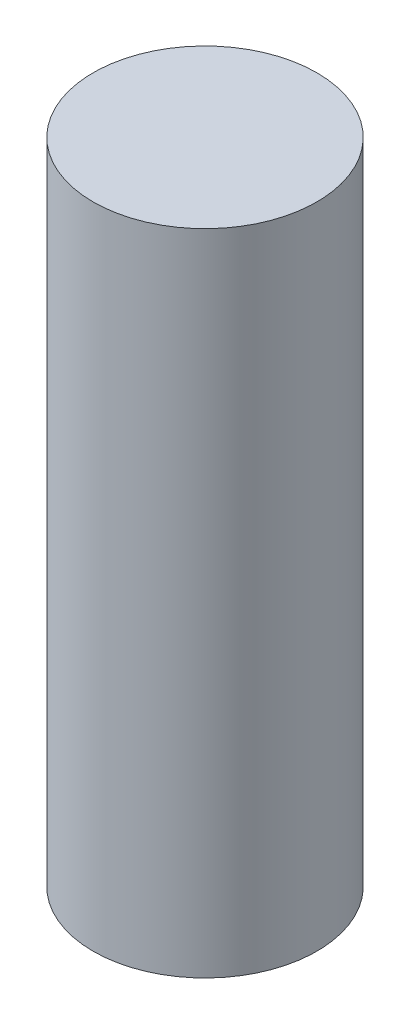
ISO-10303-21;
HEADER;
FILE_DESCRIPTION(('STEP AP214'),'2;1');
FILE_NAME('part.step','',(''),(''),'','','');
FILE_SCHEMA(('AUTOMOTIVE_DESIGN { 1 0 10303 214 1 1 1 1 }'));
ENDSEC;
DATA;
#1=APPLICATION_CONTEXT('core data for automotive mechanical design processes');
#2=APPLICATION_PROTOCOL_DEFINITION('international standard','automotive_design',2000,#1);
#3=PRODUCT_CONTEXT('',#1,'mechanical');
#4=PRODUCT('Part','Part','',(#3));
#5=PRODUCT_RELATED_PRODUCT_CATEGORY('part','',(#4));
#6=PRODUCT_DEFINITION_FORMATION('','',#4);
#7=PRODUCT_DEFINITION_CONTEXT('part definition',#1,'design');
#8=PRODUCT_DEFINITION('design','',#6,#7);
#9=PRODUCT_DEFINITION_SHAPE('','',#8);
#10=(LENGTH_UNIT() NAMED_UNIT(*) SI_UNIT(.MILLI.,.METRE.));
#11=(NAMED_UNIT(*) PLANE_ANGLE_UNIT() SI_UNIT($,.RADIAN.));
#12=(NAMED_UNIT(*) SI_UNIT($,.STERADIAN.) SOLID_ANGLE_UNIT());
#13=UNCERTAINTY_MEASURE_WITH_UNIT(LENGTH_MEASURE(1.E-05),#10,'distance_accuracy_value','');
#14=(GEOMETRIC_REPRESENTATION_CONTEXT(3) GLOBAL_UNCERTAINTY_ASSIGNED_CONTEXT((#13)) GLOBAL_UNIT_ASSIGNED_CONTEXT((#10,
#11,#12)) REPRESENTATION_CONTEXT('',''));
#15=CARTESIAN_POINT('',(0.,0.,0.));
#16=DIRECTION('',(0.,0.,1.));
#17=DIRECTION('',(1.,0.,0.));
#18=AXIS2_PLACEMENT_3D('',#15,#16,#17);
#19=CARTESIAN_POINT('',(0.,14.5,0.));
#20=DIRECTION('',(0.,-1.,0.));
#21=DIRECTION('',(0.,0.,-1.));
#22=AXIS2_PLACEMENT_3D('',#19,#20,#21);
#23=CYLINDRICAL_SURFACE('',#22,2.5);
#24=CARTESIAN_POINT('',(0.,14.5,0.));
#25=DIRECTION('',(0.,1.,0.));
#26=DIRECTION('',(0.,0.,1.));
#27=AXIS2_PLACEMENT_3D('',#24,#25,#26);
#28=CIRCLE('',#27,2.5);
#29=CARTESIAN_POINT('',(0.,14.5,2.5));
#30=VERTEX_POINT('',#29);
#31=EDGE_CURVE('E10',#30,#30,#28,.T.);
#32=ORIENTED_EDGE('',*,*,#31,.F.);
#33=EDGE_LOOP('',(#32));
#34=FACE_BOUND('',#33,.T.);
#35=CARTESIAN_POINT('',(0.,0.,0.));
#36=DIRECTION('',(0.,1.,0.));
#37=DIRECTION('',(0.,0.,1.));
#38=AXIS2_PLACEMENT_3D('',#35,#36,#37);
#39=CIRCLE('',#38,2.5);
#40=CARTESIAN_POINT('',(0.,0.,2.5));
#41=VERTEX_POINT('',#40);
#42=EDGE_CURVE('E40',#41,#41,#39,.T.);
#43=ORIENTED_EDGE('',*,*,#42,.T.);
#44=EDGE_LOOP('',(#43));
#45=FACE_BOUND('',#44,.T.);
#46=ADVANCED_FACE('F37',(#34,#45),#23,.T.);
#47=CARTESIAN_POINT('',(0.,14.5,0.));
#48=DIRECTION('',(0.,1.,0.));
#49=DIRECTION('',(0.,0.,1.));
#50=AXIS2_PLACEMENT_3D('',#47,#48,#49);
#51=PLANE('',#50);
#52=ORIENTED_EDGE('',*,*,#31,.T.);
#53=EDGE_LOOP('',(#52));
#54=FACE_BOUND('',#53,.T.);
#55=ADVANCED_FACE('F54',(#54),#51,.T.);
#56=CARTESIAN_POINT('',(0.,0.,0.));
#57=DIRECTION('',(0.,1.,0.));
#58=DIRECTION('',(0.,0.,1.));
#59=AXIS2_PLACEMENT_3D('',#56,#57,#58);
#60=PLANE('',#59);
#61=ORIENTED_EDGE('',*,*,#42,.F.);
#62=EDGE_LOOP('',(#61));
#63=FACE_BOUND('',#62,.T.);
#64=ADVANCED_FACE('F52',(#63),#60,.F.);
#65=CLOSED_SHELL('',(#46,#55,#64));
#66=MANIFOLD_SOLID_BREP('B2',#65);
#67=ADVANCED_BREP_SHAPE_REPRESENTATION('',(#18,#66),#14);
#68=SHAPE_DEFINITION_REPRESENTATION(#9,#67);
ENDSEC;
END-ISO-10303-21;
